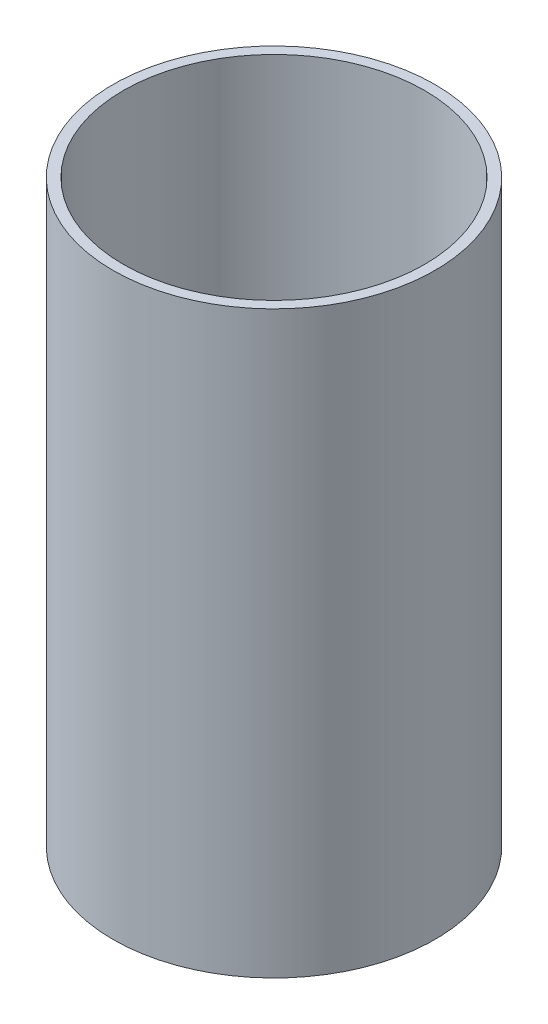
ISO-10303-21;
HEADER;
FILE_DESCRIPTION(('STEP AP214'),'2;1');
FILE_NAME('part.step','',(''),(''),'','','');
FILE_SCHEMA(('AUTOMOTIVE_DESIGN { 1 0 10303 214 1 1 1 1 }'));
ENDSEC;
DATA;
#1=APPLICATION_CONTEXT('core data for automotive mechanical design processes');
#2=APPLICATION_PROTOCOL_DEFINITION('international standard','automotive_design',2000,#1);
#3=PRODUCT_CONTEXT('',#1,'mechanical');
#4=PRODUCT('Part','Part','',(#3));
#5=PRODUCT_RELATED_PRODUCT_CATEGORY('part','',(#4));
#6=PRODUCT_DEFINITION_FORMATION('','',#4);
#7=PRODUCT_DEFINITION_CONTEXT('part definition',#1,'design');
#8=PRODUCT_DEFINITION('design','',#6,#7);
#9=PRODUCT_DEFINITION_SHAPE('','',#8);
#10=(LENGTH_UNIT() NAMED_UNIT(*) SI_UNIT(.MILLI.,.METRE.));
#11=(NAMED_UNIT(*) PLANE_ANGLE_UNIT() SI_UNIT($,.RADIAN.));
#12=(NAMED_UNIT(*) SI_UNIT($,.STERADIAN.) SOLID_ANGLE_UNIT());
#13=UNCERTAINTY_MEASURE_WITH_UNIT(LENGTH_MEASURE(1.E-05),#10,'distance_accuracy_value','');
#14=(GEOMETRIC_REPRESENTATION_CONTEXT(3) GLOBAL_UNCERTAINTY_ASSIGNED_CONTEXT((#13)) GLOBAL_UNIT_ASSIGNED_CONTEXT((#10,
#11,#12)) REPRESENTATION_CONTEXT('',''));
#15=CARTESIAN_POINT('',(0.,0.,0.));
#16=DIRECTION('',(0.,0.,1.));
#17=DIRECTION('',(1.,0.,0.));
#18=AXIS2_PLACEMENT_3D('',#15,#16,#17);
#19=CARTESIAN_POINT('',(0.,3.175,0.));
#20=DIRECTION('',(0.,1.,0.));
#21=DIRECTION('',(0.,0.,1.));
#22=AXIS2_PLACEMENT_3D('',#19,#20,#21);
#23=PLANE('',#22);
#24=CARTESIAN_POINT('',(0.,3.175,0.));
#25=DIRECTION('',(0.,-1.,0.));
#26=DIRECTION('',(0.,0.,-1.));
#27=AXIS2_PLACEMENT_3D('',#24,#25,#26);
#28=CIRCLE('',#27,46.228);
#29=CARTESIAN_POINT('',(0.,3.175,-46.228));
#30=VERTEX_POINT('',#29);
#31=EDGE_CURVE('E10',#30,#30,#28,.T.);
#32=ORIENTED_EDGE('',*,*,#31,.F.);
#33=EDGE_LOOP('',(#32));
#34=FACE_BOUND('',#33,.T.);
#35=ADVANCED_FACE('F36',(#34),#23,.T.);
#36=CARTESIAN_POINT('',(0.,-8.89,0.));
#37=DIRECTION('',(0.,-1.,0.));
#38=DIRECTION('',(0.,0.,-1.));
#39=AXIS2_PLACEMENT_3D('',#36,#37,#38);
#40=CYLINDRICAL_SURFACE('',#39,46.228);
#41=ORIENTED_EDGE('',*,*,#31,.T.);
#42=EDGE_LOOP('',(#41));
#43=FACE_BOUND('',#42,.T.);
#44=CARTESIAN_POINT('',(0.,177.8,0.));
#45=DIRECTION('',(0.,-1.,0.));
#46=DIRECTION('',(0.,0.,-1.));
#47=AXIS2_PLACEMENT_3D('',#44,#45,#46);
#48=CIRCLE('',#47,46.228);
#49=CARTESIAN_POINT('',(0.,177.8,-46.228));
#50=VERTEX_POINT('',#49);
#51=EDGE_CURVE('E42',#50,#50,#48,.T.);
#52=ORIENTED_EDGE('',*,*,#51,.F.);
#53=EDGE_LOOP('',(#52));
#54=FACE_BOUND('',#53,.T.);
#55=ADVANCED_FACE('F68',(#43,#54),#40,.F.);
#56=CARTESIAN_POINT('',(49.403,177.8,0.));
#57=DIRECTION('',(0.,1.,0.));
#58=DIRECTION('',(0.,0.,1.));
#59=AXIS2_PLACEMENT_3D('',#56,#57,#58);
#60=PLANE('',#59);
#61=ORIENTED_EDGE('',*,*,#51,.T.);
#62=EDGE_LOOP('',(#61));
#63=FACE_BOUND('',#62,.T.);
#64=CARTESIAN_POINT('',(0.,177.8,0.));
#65=DIRECTION('',(0.,-1.,0.));
#66=DIRECTION('',(0.,0.,-1.));
#67=AXIS2_PLACEMENT_3D('',#64,#65,#66);
#68=CIRCLE('',#67,49.403);
#69=CARTESIAN_POINT('',(0.,177.8,-49.403));
#70=VERTEX_POINT('',#69);
#71=EDGE_CURVE('E46',#70,#70,#68,.T.);
#72=ORIENTED_EDGE('',*,*,#71,.F.);
#73=EDGE_LOOP('',(#72));
#74=FACE_BOUND('',#73,.T.);
#75=ADVANCED_FACE('F60',(#63,#74),#60,.T.);
#76=CARTESIAN_POINT('',(0.,-8.89,0.));
#77=DIRECTION('',(0.,-1.,0.));
#78=DIRECTION('',(0.,0.,-1.));
#79=AXIS2_PLACEMENT_3D('',#76,#77,#78);
#80=CYLINDRICAL_SURFACE('',#79,49.403);
#81=ORIENTED_EDGE('',*,*,#71,.T.);
#82=EDGE_LOOP('',(#81));
#83=FACE_BOUND('',#82,.T.);
#84=CARTESIAN_POINT('',(0.,0.,0.));
#85=DIRECTION('',(0.,-1.,0.));
#86=DIRECTION('',(0.,0.,-1.));
#87=AXIS2_PLACEMENT_3D('',#84,#85,#86);
#88=CIRCLE('',#87,49.403);
#89=CARTESIAN_POINT('',(0.,0.,-49.403));
#90=VERTEX_POINT('',#89);
#91=EDGE_CURVE('E50',#90,#90,#88,.T.);
#92=ORIENTED_EDGE('',*,*,#91,.F.);
#93=EDGE_LOOP('',(#92));
#94=FACE_BOUND('',#93,.T.);
#95=ADVANCED_FACE('F58',(#83,#94),#80,.T.);
#96=CARTESIAN_POINT('',(0.,0.,0.));
#97=DIRECTION('',(0.,-1.,0.));
#98=DIRECTION('',(0.,0.,-1.));
#99=AXIS2_PLACEMENT_3D('',#96,#97,#98);
#100=PLANE('',#99);
#101=ORIENTED_EDGE('',*,*,#91,.T.);
#102=EDGE_LOOP('',(#101));
#103=FACE_BOUND('',#102,.T.);
#104=ADVANCED_FACE('F56',(#103),#100,.T.);
#105=CLOSED_SHELL('',(#35,#55,#75,#95,#104));
#106=MANIFOLD_SOLID_BREP('B2',#105);
#107=ADVANCED_BREP_SHAPE_REPRESENTATION('',(#18,#106),#14);
#108=SHAPE_DEFINITION_REPRESENTATION(#9,#107);
ENDSEC;
END-ISO-10303-21;
